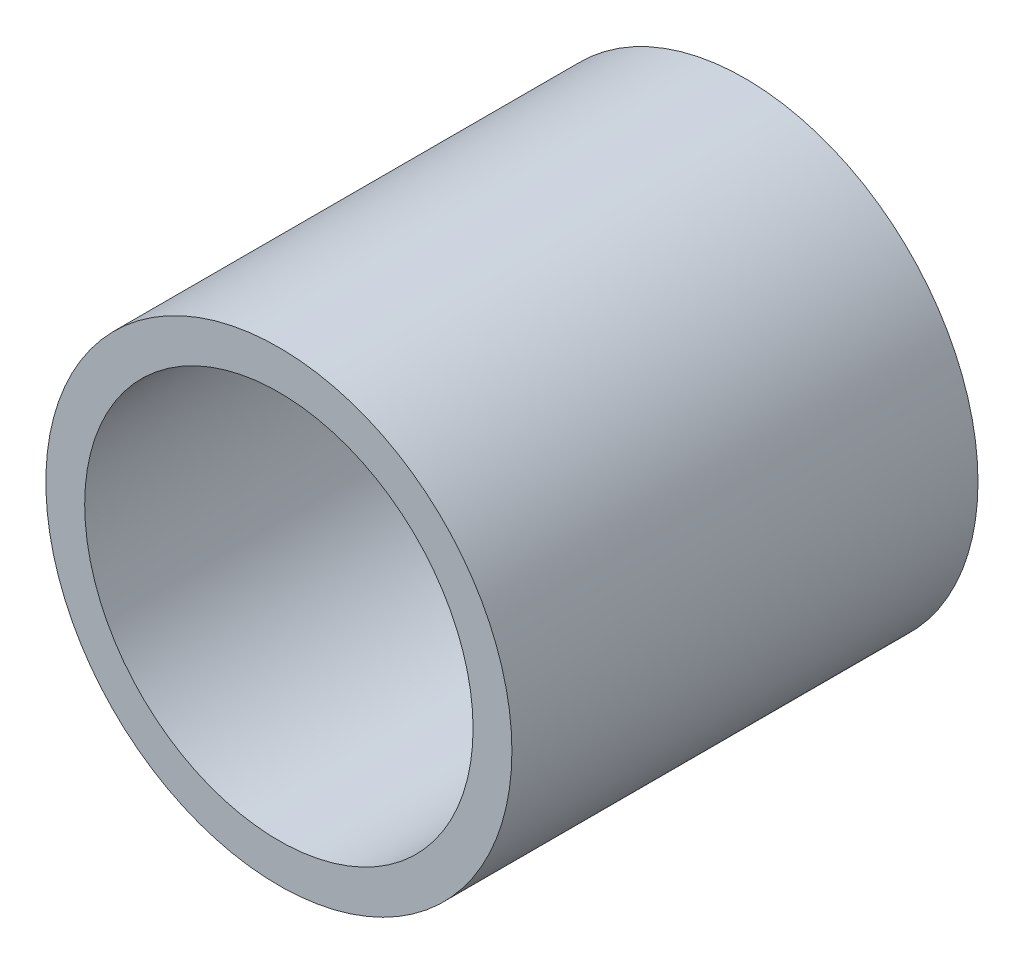
ISO-10303-21;
HEADER;
FILE_DESCRIPTION(('STEP AP214'),'2;1');
FILE_NAME('part.step','',(''),(''),'','','');
FILE_SCHEMA(('AUTOMOTIVE_DESIGN { 1 0 10303 214 1 1 1 1 }'));
ENDSEC;
DATA;
#1=APPLICATION_CONTEXT('core data for automotive mechanical design processes');
#2=APPLICATION_PROTOCOL_DEFINITION('international standard','automotive_design',2000,#1);
#3=PRODUCT_CONTEXT('',#1,'mechanical');
#4=PRODUCT('Part','Part','',(#3));
#5=PRODUCT_RELATED_PRODUCT_CATEGORY('part','',(#4));
#6=PRODUCT_DEFINITION_FORMATION('','',#4);
#7=PRODUCT_DEFINITION_CONTEXT('part definition',#1,'design');
#8=PRODUCT_DEFINITION('design','',#6,#7);
#9=PRODUCT_DEFINITION_SHAPE('','',#8);
#10=(LENGTH_UNIT() NAMED_UNIT(*) SI_UNIT(.MILLI.,.METRE.));
#11=(NAMED_UNIT(*) PLANE_ANGLE_UNIT() SI_UNIT($,.RADIAN.));
#12=(NAMED_UNIT(*) SI_UNIT($,.STERADIAN.) SOLID_ANGLE_UNIT());
#13=UNCERTAINTY_MEASURE_WITH_UNIT(LENGTH_MEASURE(1.E-05),#10,'distance_accuracy_value','');
#14=(GEOMETRIC_REPRESENTATION_CONTEXT(3) GLOBAL_UNCERTAINTY_ASSIGNED_CONTEXT((#13)) GLOBAL_UNIT_ASSIGNED_CONTEXT((#10,
#11,#12)) REPRESENTATION_CONTEXT('',''));
#15=CARTESIAN_POINT('',(0.,0.,0.));
#16=DIRECTION('',(0.,0.,1.));
#17=DIRECTION('',(1.,0.,0.));
#18=AXIS2_PLACEMENT_3D('',#15,#16,#17);
#19=CARTESIAN_POINT('',(0.,0.,24.));
#20=DIRECTION('',(0.,0.,-1.));
#21=DIRECTION('',(-1.,0.,0.));
#22=AXIS2_PLACEMENT_3D('',#19,#20,#21);
#23=CYLINDRICAL_SURFACE('',#22,1.5);
#24=CARTESIAN_POINT('',(0.,0.,4.));
#25=DIRECTION('',(0.,0.,1.));
#26=DIRECTION('',(1.,0.,0.));
#27=AXIS2_PLACEMENT_3D('',#24,#25,#26);
#28=CIRCLE('',#27,1.5);
#29=CARTESIAN_POINT('',(1.5,0.,4.));
#30=VERTEX_POINT('',#29);
#31=EDGE_CURVE('E48',#30,#30,#28,.T.);
#32=ORIENTED_EDGE('',*,*,#31,.T.);
#33=EDGE_LOOP('',(#32));
#34=FACE_BOUND('',#33,.T.);
#35=CARTESIAN_POINT('',(0.,0.,3.5));
#36=DIRECTION('',(0.,0.,-1.));
#37=DIRECTION('',(-1.,0.,0.));
#38=AXIS2_PLACEMENT_3D('',#35,#36,#37);
#39=CIRCLE('',#38,1.5);
#40=CARTESIAN_POINT('',(-1.5,0.,3.5));
#41=VERTEX_POINT('',#40);
#42=EDGE_CURVE('E52',#41,#41,#39,.F.);
#43=ORIENTED_EDGE('',*,*,#42,.F.);
#44=EDGE_LOOP('',(#43));
#45=FACE_BOUND('',#44,.T.);
#46=ADVANCED_FACE('F31',(#34,#45),#23,.F.);
#47=CARTESIAN_POINT('',(0.,0.,4.));
#48=DIRECTION('',(0.,0.,-1.));
#49=DIRECTION('',(-1.,0.,0.));
#50=AXIS2_PLACEMENT_3D('',#47,#48,#49);
#51=CYLINDRICAL_SURFACE('',#50,12.);
#52=CARTESIAN_POINT('',(0.,0.,0.));
#53=DIRECTION('',(0.,0.,1.));
#54=DIRECTION('',(1.,0.,0.));
#55=AXIS2_PLACEMENT_3D('',#52,#53,#54);
#56=CIRCLE('',#55,12.);
#57=CARTESIAN_POINT('',(12.,0.,0.));
#58=VERTEX_POINT('',#57);
#59=EDGE_CURVE('E39',#58,#58,#56,.T.);
#60=ORIENTED_EDGE('',*,*,#59,.T.);
#61=EDGE_LOOP('',(#60));
#62=FACE_BOUND('',#61,.T.);
#63=CARTESIAN_POINT('',(0.,0.,24.));
#64=DIRECTION('',(0.,0.,1.));
#65=DIRECTION('',(1.,0.,0.));
#66=AXIS2_PLACEMENT_3D('',#63,#64,#65);
#67=CIRCLE('',#66,12.);
#68=CARTESIAN_POINT('',(12.,0.,24.));
#69=VERTEX_POINT('',#68);
#70=EDGE_CURVE('E44',#69,#69,#67,.T.);
#71=ORIENTED_EDGE('',*,*,#70,.F.);
#72=EDGE_LOOP('',(#71));
#73=FACE_BOUND('',#72,.T.);
#74=ADVANCED_FACE('F33',(#62,#73),#51,.T.);
#75=CARTESIAN_POINT('',(0.,0.,0.));
#76=DIRECTION('',(0.,0.,1.));
#77=DIRECTION('',(1.,0.,0.));
#78=AXIS2_PLACEMENT_3D('',#75,#76,#77);
#79=PLANE('',#78);
#80=CARTESIAN_POINT('',(-5.,0.,0.));
#81=DIRECTION('',(0.,0.,-1.));
#82=DIRECTION('',(1.,0.,0.));
#83=AXIS2_PLACEMENT_3D('',#80,#81,#82);
#84=CIRCLE('',#83,1.);
#85=CARTESIAN_POINT('',(-4.,0.,0.));
#86=VERTEX_POINT('',#85);
#87=EDGE_CURVE('E68',#86,#86,#84,.T.);
#88=ORIENTED_EDGE('',*,*,#87,.F.);
#89=EDGE_LOOP('',(#88));
#90=FACE_BOUND('',#89,.T.);
#91=CARTESIAN_POINT('',(5.,0.,0.));
#92=DIRECTION('',(0.,0.,-1.));
#93=DIRECTION('',(-1.,0.,0.));
#94=AXIS2_PLACEMENT_3D('',#91,#92,#93);
#95=CIRCLE('',#94,1.);
#96=CARTESIAN_POINT('',(4.,0.,0.));
#97=VERTEX_POINT('',#96);
#98=EDGE_CURVE('E58',#97,#97,#95,.T.);
#99=ORIENTED_EDGE('',*,*,#98,.F.);
#100=EDGE_LOOP('',(#99));
#101=FACE_BOUND('',#100,.T.);
#102=CARTESIAN_POINT('',(0.,0.,0.));
#103=DIRECTION('',(0.,0.,-1.));
#104=DIRECTION('',(-1.,0.,0.));
#105=AXIS2_PLACEMENT_3D('',#102,#103,#104);
#106=CIRCLE('',#105,2.5);
#107=CARTESIAN_POINT('',(-2.5,0.,0.));
#108=VERTEX_POINT('',#107);
#109=EDGE_CURVE('E57',#108,#108,#106,.T.);
#110=ORIENTED_EDGE('',*,*,#109,.F.);
#111=EDGE_LOOP('',(#110));
#112=FACE_BOUND('',#111,.T.);
#113=ORIENTED_EDGE('',*,*,#59,.F.);
#114=EDGE_LOOP('',(#113));
#115=FACE_BOUND('',#114,.T.);
#116=ADVANCED_FACE('F81',(#90,#101,#112,#115),#79,.F.);
#117=CARTESIAN_POINT('',(0.,0.,24.));
#118=DIRECTION('',(0.,0.,1.));
#119=DIRECTION('',(1.,0.,0.));
#120=AXIS2_PLACEMENT_3D('',#117,#118,#119);
#121=PLANE('',#120);
#122=ORIENTED_EDGE('',*,*,#70,.T.);
#123=EDGE_LOOP('',(#122));
#124=FACE_BOUND('',#123,.T.);
#125=CARTESIAN_POINT('',(0.,0.,24.));
#126=DIRECTION('',(0.,0.,1.));
#127=DIRECTION('',(1.,0.,0.));
#128=AXIS2_PLACEMENT_3D('',#125,#126,#127);
#129=CIRCLE('',#128,10.);
#130=CARTESIAN_POINT('',(10.,0.,24.));
#131=VERTEX_POINT('',#130);
#132=EDGE_CURVE('E51',#131,#131,#129,.T.);
#133=ORIENTED_EDGE('',*,*,#132,.F.);
#134=EDGE_LOOP('',(#133));
#135=FACE_BOUND('',#134,.T.);
#136=ADVANCED_FACE('F77',(#124,#135),#121,.T.);
#137=CARTESIAN_POINT('',(0.,0.,24.));
#138=DIRECTION('',(0.,0.,-1.));
#139=DIRECTION('',(-1.,0.,0.));
#140=AXIS2_PLACEMENT_3D('',#137,#138,#139);
#141=CYLINDRICAL_SURFACE('',#140,10.);
#142=ORIENTED_EDGE('',*,*,#132,.T.);
#143=EDGE_LOOP('',(#142));
#144=FACE_BOUND('',#143,.T.);
#145=CARTESIAN_POINT('',(0.,0.,4.));
#146=DIRECTION('',(0.,0.,1.));
#147=DIRECTION('',(1.,0.,0.));
#148=AXIS2_PLACEMENT_3D('',#145,#146,#147);
#149=CIRCLE('',#148,10.);
#150=CARTESIAN_POINT('',(10.,0.,4.));
#151=VERTEX_POINT('',#150);
#152=EDGE_CURVE('E10',#151,#151,#149,.F.);
#153=ORIENTED_EDGE('',*,*,#152,.T.);
#154=EDGE_LOOP('',(#153));
#155=FACE_BOUND('',#154,.T.);
#156=ADVANCED_FACE('F99',(#144,#155),#141,.F.);
#157=CARTESIAN_POINT('',(0.,0.,4.));
#158=DIRECTION('',(0.,0.,1.));
#159=DIRECTION('',(1.,0.,0.));
#160=AXIS2_PLACEMENT_3D('',#157,#158,#159);
#161=PLANE('',#160);
#162=CARTESIAN_POINT('',(-5.,0.,4.));
#163=DIRECTION('',(0.,0.,1.));
#164=DIRECTION('',(1.,0.,0.));
#165=AXIS2_PLACEMENT_3D('',#162,#163,#164);
#166=CIRCLE('',#165,1.);
#167=CARTESIAN_POINT('',(-4.,0.,4.));
#168=VERTEX_POINT('',#167);
#169=EDGE_CURVE('E35',#168,#168,#166,.T.);
#170=ORIENTED_EDGE('',*,*,#169,.F.);
#171=EDGE_LOOP('',(#170));
#172=FACE_BOUND('',#171,.T.);
#173=CARTESIAN_POINT('',(5.,0.,4.));
#174=DIRECTION('',(0.,0.,1.));
#175=DIRECTION('',(1.,0.,0.));
#176=AXIS2_PLACEMENT_3D('',#173,#174,#175);
#177=CIRCLE('',#176,1.);
#178=CARTESIAN_POINT('',(6.,0.,4.));
#179=VERTEX_POINT('',#178);
#180=EDGE_CURVE('E55',#179,#179,#177,.T.);
#181=ORIENTED_EDGE('',*,*,#180,.F.);
#182=EDGE_LOOP('',(#181));
#183=FACE_BOUND('',#182,.T.);
#184=ORIENTED_EDGE('',*,*,#31,.F.);
#185=EDGE_LOOP('',(#184));
#186=FACE_BOUND('',#185,.T.);
#187=ORIENTED_EDGE('',*,*,#152,.F.);
#188=EDGE_LOOP('',(#187));
#189=FACE_BOUND('',#188,.T.);
#190=ADVANCED_FACE('F102',(#172,#183,#186,#189),#161,.T.);
#191=CARTESIAN_POINT('',(0.,0.,3.5));
#192=DIRECTION('',(0.,0.,-1.));
#193=DIRECTION('',(-1.,0.,0.));
#194=AXIS2_PLACEMENT_3D('',#191,#192,#193);
#195=PLANE('',#194);
#196=CARTESIAN_POINT('',(0.,0.,3.5));
#197=DIRECTION('',(0.,0.,-1.));
#198=DIRECTION('',(-1.,0.,0.));
#199=AXIS2_PLACEMENT_3D('',#196,#197,#198);
#200=CIRCLE('',#199,2.5);
#201=CARTESIAN_POINT('',(-2.5,0.,3.5));
#202=VERTEX_POINT('',#201);
#203=EDGE_CURVE('E54',#202,#202,#200,.T.);
#204=ORIENTED_EDGE('',*,*,#203,.T.);
#205=EDGE_LOOP('',(#204));
#206=FACE_BOUND('',#205,.T.);
#207=ORIENTED_EDGE('',*,*,#42,.T.);
#208=EDGE_LOOP('',(#207));
#209=FACE_BOUND('',#208,.T.);
#210=ADVANCED_FACE('F107',(#206,#209),#195,.T.);
#211=CARTESIAN_POINT('',(0.,0.,3.5));
#212=DIRECTION('',(0.,0.,-1.));
#213=DIRECTION('',(-1.,0.,0.));
#214=AXIS2_PLACEMENT_3D('',#211,#212,#213);
#215=CYLINDRICAL_SURFACE('',#214,2.5);
#216=ORIENTED_EDGE('',*,*,#203,.F.);
#217=EDGE_LOOP('',(#216));
#218=FACE_BOUND('',#217,.T.);
#219=ORIENTED_EDGE('',*,*,#109,.T.);
#220=EDGE_LOOP('',(#219));
#221=FACE_BOUND('',#220,.T.);
#222=ADVANCED_FACE('F97',(#218,#221),#215,.F.);
#223=CARTESIAN_POINT('',(5.,0.,24.));
#224=DIRECTION('',(0.,0.,-1.));
#225=DIRECTION('',(-1.,0.,0.));
#226=AXIS2_PLACEMENT_3D('',#223,#224,#225);
#227=CYLINDRICAL_SURFACE('',#226,1.);
#228=ORIENTED_EDGE('',*,*,#180,.T.);
#229=EDGE_LOOP('',(#228));
#230=FACE_BOUND('',#229,.T.);
#231=ORIENTED_EDGE('',*,*,#98,.T.);
#232=EDGE_LOOP('',(#231));
#233=FACE_BOUND('',#232,.T.);
#234=ADVANCED_FACE('F122',(#230,#233),#227,.F.);
#235=CARTESIAN_POINT('',(-5.,0.,24.));
#236=DIRECTION('',(0.,0.,-1.));
#237=DIRECTION('',(-1.,0.,0.));
#238=AXIS2_PLACEMENT_3D('',#235,#236,#237);
#239=CYLINDRICAL_SURFACE('',#238,1.);
#240=ORIENTED_EDGE('',*,*,#169,.T.);
#241=EDGE_LOOP('',(#240));
#242=FACE_BOUND('',#241,.T.);
#243=ORIENTED_EDGE('',*,*,#87,.T.);
#244=EDGE_LOOP('',(#243));
#245=FACE_BOUND('',#244,.T.);
#246=ADVANCED_FACE('F119',(#242,#245),#239,.F.);
#247=CLOSED_SHELL('',(#46,#74,#116,#136,#156,#190,#210,#222,#234,#246));
#248=MANIFOLD_SOLID_BREP('B2',#247);
#249=ADVANCED_BREP_SHAPE_REPRESENTATION('',(#18,#248),#14);
#250=SHAPE_DEFINITION_REPRESENTATION(#9,#249);
ENDSEC;
END-ISO-10303-21;
